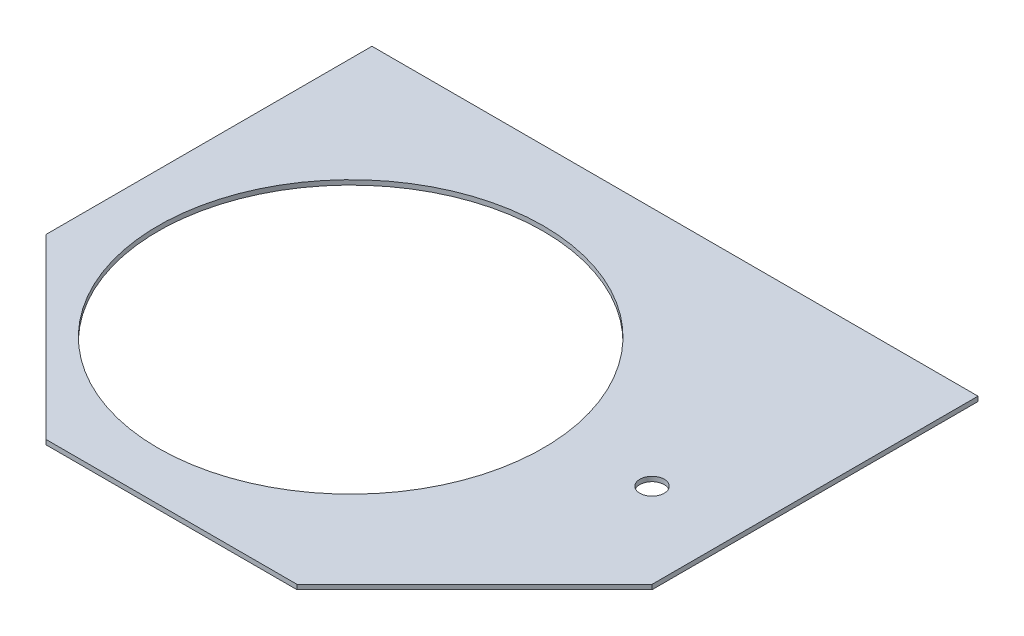
ISO-10303-21;
HEADER;
FILE_DESCRIPTION(('STEP AP214'),'2;1');
FILE_NAME('part.step','',(''),(''),'','','');
FILE_SCHEMA(('AUTOMOTIVE_DESIGN { 1 0 10303 214 1 1 1 1 }'));
ENDSEC;
DATA;
#1=APPLICATION_CONTEXT('core data for automotive mechanical design processes');
#2=APPLICATION_PROTOCOL_DEFINITION('international standard','automotive_design',2000,#1);
#3=PRODUCT_CONTEXT('',#1,'mechanical');
#4=PRODUCT('Part','Part','',(#3));
#5=PRODUCT_RELATED_PRODUCT_CATEGORY('part','',(#4));
#6=PRODUCT_DEFINITION_FORMATION('','',#4);
#7=PRODUCT_DEFINITION_CONTEXT('part definition',#1,'design');
#8=PRODUCT_DEFINITION('design','',#6,#7);
#9=PRODUCT_DEFINITION_SHAPE('','',#8);
#10=(LENGTH_UNIT() NAMED_UNIT(*) SI_UNIT(.MILLI.,.METRE.));
#11=(NAMED_UNIT(*) PLANE_ANGLE_UNIT() SI_UNIT($,.RADIAN.));
#12=(NAMED_UNIT(*) SI_UNIT($,.STERADIAN.) SOLID_ANGLE_UNIT());
#13=UNCERTAINTY_MEASURE_WITH_UNIT(LENGTH_MEASURE(1.E-05),#10,'distance_accuracy_value','');
#14=(GEOMETRIC_REPRESENTATION_CONTEXT(3) GLOBAL_UNCERTAINTY_ASSIGNED_CONTEXT((#13)) GLOBAL_UNIT_ASSIGNED_CONTEXT((#10,
#11,#12)) REPRESENTATION_CONTEXT('',''));
#15=CARTESIAN_POINT('',(0.,0.,0.));
#16=DIRECTION('',(0.,0.,1.));
#17=DIRECTION('',(1.,0.,0.));
#18=AXIS2_PLACEMENT_3D('',#15,#16,#17);
#19=CARTESIAN_POINT('',(-205.417689271226,3.175,-85.086792847484));
#20=DIRECTION('',(1.,0.,0.));
#21=DIRECTION('',(0.,0.,-1.));
#22=AXIS2_PLACEMENT_3D('',#19,#20,#21);
#23=PLANE('',#22);
#24=DIRECTION('',(0.,0.,1.));
#25=VECTOR('',#24,1.);
#26=CARTESIAN_POINT('',(-205.417689271226,0.,-85.086792847484));
#27=LINE('',#26,#25);
#28=CARTESIAN_POINT('',(-205.417689271226,0.,-135.886792847484));
#29=VERTEX_POINT('',#28);
#30=CARTESIAN_POINT('',(-205.417689271226,0.,85.0867928474841));
#31=VERTEX_POINT('',#30);
#32=EDGE_CURVE('E76',#29,#31,#27,.T.);
#33=ORIENTED_EDGE('',*,*,#32,.T.);
#34=DIRECTION('',(0.,-1.,0.));
#35=VECTOR('',#34,1.);
#36=CARTESIAN_POINT('',(-205.417689271226,3.175,85.0867928474841));
#37=LINE('',#36,#35);
#38=CARTESIAN_POINT('',(-205.417689271226,3.175,85.0867928474841));
#39=VERTEX_POINT('',#38);
#40=EDGE_CURVE('E11',#39,#31,#37,.T.);
#41=ORIENTED_EDGE('',*,*,#40,.F.);
#42=DIRECTION('',(0.,0.,1.));
#43=VECTOR('',#42,1.);
#44=CARTESIAN_POINT('',(-205.417689271226,3.175,-85.086792847484));
#45=LINE('',#44,#43);
#46=CARTESIAN_POINT('',(-205.417689271226,3.175,-135.886792847484));
#47=VERTEX_POINT('',#46);
#48=EDGE_CURVE('E82',#47,#39,#45,.T.);
#49=ORIENTED_EDGE('',*,*,#48,.F.);
#50=DIRECTION('',(0.,-1.,0.));
#51=VECTOR('',#50,1.);
#52=CARTESIAN_POINT('',(-205.417689271226,3.175,-135.886792847484));
#53=LINE('',#52,#51);
#54=EDGE_CURVE('E111',#47,#29,#53,.T.);
#55=ORIENTED_EDGE('',*,*,#54,.T.);
#56=EDGE_LOOP('',(#33,#41,#49,#55));
#57=FACE_BOUND('',#56,.T.);
#58=ADVANCED_FACE('F31',(#57),#23,.F.);
#59=CARTESIAN_POINT('',(-205.417689271226,3.175,85.0867928474841));
#60=DIRECTION('',(0.707106781186547,0.,-0.707106781186548));
#61=DIRECTION('',(-0.707106781186548,0.,-0.707106781186547));
#62=AXIS2_PLACEMENT_3D('',#59,#60,#61);
#63=PLANE('',#62);
#64=DIRECTION('',(0.707106781186548,0.,0.707106781186547));
#65=VECTOR('',#64,1.);
#66=CARTESIAN_POINT('',(-205.417689271226,0.,85.0867928474841));
#67=LINE('',#66,#65);
#68=CARTESIAN_POINT('',(-85.0867928474838,0.,205.417689271226));
#69=VERTEX_POINT('',#68);
#70=EDGE_CURVE('E116',#31,#69,#67,.T.);
#71=ORIENTED_EDGE('',*,*,#70,.T.);
#72=DIRECTION('',(0.,-1.,0.));
#73=VECTOR('',#72,1.);
#74=CARTESIAN_POINT('',(-85.0867928474838,3.175,205.417689271226));
#75=LINE('',#74,#73);
#76=CARTESIAN_POINT('',(-85.0867928474838,3.175,205.417689271226));
#77=VERTEX_POINT('',#76);
#78=EDGE_CURVE('E39',#77,#69,#75,.T.);
#79=ORIENTED_EDGE('',*,*,#78,.F.);
#80=DIRECTION('',(0.707106781186548,0.,0.707106781186547));
#81=VECTOR('',#80,1.);
#82=CARTESIAN_POINT('',(-205.417689271226,3.175,85.0867928474841));
#83=LINE('',#82,#81);
#84=EDGE_CURVE('E139',#39,#77,#83,.T.);
#85=ORIENTED_EDGE('',*,*,#84,.F.);
#86=ORIENTED_EDGE('',*,*,#40,.T.);
#87=EDGE_LOOP('',(#71,#79,#85,#86));
#88=FACE_BOUND('',#87,.T.);
#89=ADVANCED_FACE('F178',(#88),#63,.F.);
#90=CARTESIAN_POINT('',(-85.0867928474838,3.175,205.417689271226));
#91=DIRECTION('',(0.,0.,-1.));
#92=DIRECTION('',(-1.,0.,0.));
#93=AXIS2_PLACEMENT_3D('',#90,#91,#92);
#94=PLANE('',#93);
#95=DIRECTION('',(1.,0.,0.));
#96=VECTOR('',#95,1.);
#97=CARTESIAN_POINT('',(-85.0867928474838,0.,205.417689271226));
#98=LINE('',#97,#96);
#99=CARTESIAN_POINT('',(85.086792847484,0.,205.417689271226));
#100=VERTEX_POINT('',#99);
#101=EDGE_CURVE('E119',#69,#100,#98,.T.);
#102=ORIENTED_EDGE('',*,*,#101,.T.);
#103=DIRECTION('',(0.,-1.,0.));
#104=VECTOR('',#103,1.);
#105=CARTESIAN_POINT('',(85.086792847484,3.175,205.417689271226));
#106=LINE('',#105,#104);
#107=CARTESIAN_POINT('',(85.086792847484,3.175,205.417689271226));
#108=VERTEX_POINT('',#107);
#109=EDGE_CURVE('E106',#108,#100,#106,.T.);
#110=ORIENTED_EDGE('',*,*,#109,.F.);
#111=DIRECTION('',(1.,0.,0.));
#112=VECTOR('',#111,1.);
#113=CARTESIAN_POINT('',(-85.0867928474838,3.175,205.417689271226));
#114=LINE('',#113,#112);
#115=EDGE_CURVE('E96',#77,#108,#114,.T.);
#116=ORIENTED_EDGE('',*,*,#115,.F.);
#117=ORIENTED_EDGE('',*,*,#78,.T.);
#118=EDGE_LOOP('',(#102,#110,#116,#117));
#119=FACE_BOUND('',#118,.T.);
#120=ADVANCED_FACE('F132',(#119),#94,.F.);
#121=CARTESIAN_POINT('',(85.086792847484,3.175,205.417689271226));
#122=DIRECTION('',(-0.707106781186548,0.,-0.707106781186547));
#123=DIRECTION('',(-0.707106781186547,0.,0.707106781186548));
#124=AXIS2_PLACEMENT_3D('',#121,#122,#123);
#125=PLANE('',#124);
#126=DIRECTION('',(0.707106781186547,0.,-0.707106781186548));
#127=VECTOR('',#126,1.);
#128=CARTESIAN_POINT('',(85.086792847484,0.,205.417689271226));
#129=LINE('',#128,#127);
#130=CARTESIAN_POINT('',(205.417689271226,0.,85.086792847484));
#131=VERTEX_POINT('',#130);
#132=EDGE_CURVE('E105',#100,#131,#129,.T.);
#133=ORIENTED_EDGE('',*,*,#132,.T.);
#134=DIRECTION('',(0.,-1.,0.));
#135=VECTOR('',#134,1.);
#136=CARTESIAN_POINT('',(205.417689271226,3.175,85.086792847484));
#137=LINE('',#136,#135);
#138=CARTESIAN_POINT('',(205.417689271226,3.175,85.086792847484));
#139=VERTEX_POINT('',#138);
#140=EDGE_CURVE('E102',#139,#131,#137,.T.);
#141=ORIENTED_EDGE('',*,*,#140,.F.);
#142=DIRECTION('',(0.707106781186547,0.,-0.707106781186548));
#143=VECTOR('',#142,1.);
#144=CARTESIAN_POINT('',(85.086792847484,3.175,205.417689271226));
#145=LINE('',#144,#143);
#146=EDGE_CURVE('E90',#108,#139,#145,.T.);
#147=ORIENTED_EDGE('',*,*,#146,.F.);
#148=ORIENTED_EDGE('',*,*,#109,.T.);
#149=EDGE_LOOP('',(#133,#141,#147,#148));
#150=FACE_BOUND('',#149,.T.);
#151=ADVANCED_FACE('F103',(#150),#125,.F.);
#152=CARTESIAN_POINT('',(205.417689271226,3.175,-135.886792847484));
#153=DIRECTION('',(-1.,0.,0.));
#154=DIRECTION('',(0.,0.,1.));
#155=AXIS2_PLACEMENT_3D('',#152,#153,#154);
#156=PLANE('',#155);
#157=DIRECTION('',(0.,0.,-1.));
#158=VECTOR('',#157,1.);
#159=CARTESIAN_POINT('',(205.417689271226,0.,-135.886792847484));
#160=LINE('',#159,#158);
#161=CARTESIAN_POINT('',(205.417689271226,0.,-135.886792847484));
#162=VERTEX_POINT('',#161);
#163=EDGE_CURVE('E69',#131,#162,#160,.T.);
#164=ORIENTED_EDGE('',*,*,#163,.T.);
#165=DIRECTION('',(0.,-1.,0.));
#166=VECTOR('',#165,1.);
#167=CARTESIAN_POINT('',(205.417689271226,3.175,-135.886792847484));
#168=LINE('',#167,#166);
#169=CARTESIAN_POINT('',(205.417689271226,3.175,-135.886792847484));
#170=VERTEX_POINT('',#169);
#171=EDGE_CURVE('E107',#170,#162,#168,.T.);
#172=ORIENTED_EDGE('',*,*,#171,.F.);
#173=DIRECTION('',(0.,0.,-1.));
#174=VECTOR('',#173,1.);
#175=CARTESIAN_POINT('',(205.417689271226,3.175,85.086792847484));
#176=LINE('',#175,#174);
#177=EDGE_CURVE('E94',#139,#170,#176,.T.);
#178=ORIENTED_EDGE('',*,*,#177,.F.);
#179=ORIENTED_EDGE('',*,*,#140,.T.);
#180=EDGE_LOOP('',(#164,#172,#178,#179));
#181=FACE_BOUND('',#180,.T.);
#182=ADVANCED_FACE('F109',(#181),#156,.F.);
#183=CARTESIAN_POINT('',(-205.417689271226,3.175,-135.886792847484));
#184=DIRECTION('',(0.,0.,1.));
#185=DIRECTION('',(1.,0.,0.));
#186=AXIS2_PLACEMENT_3D('',#183,#184,#185);
#187=PLANE('',#186);
#188=DIRECTION('',(-1.,0.,0.));
#189=VECTOR('',#188,1.);
#190=CARTESIAN_POINT('',(-205.417689271226,0.,-135.886792847484));
#191=LINE('',#190,#189);
#192=EDGE_CURVE('E123',#162,#29,#191,.T.);
#193=ORIENTED_EDGE('',*,*,#192,.T.);
#194=ORIENTED_EDGE('',*,*,#54,.F.);
#195=DIRECTION('',(-1.,0.,0.));
#196=VECTOR('',#195,1.);
#197=CARTESIAN_POINT('',(-205.417689271226,3.175,-135.886792847484));
#198=LINE('',#197,#196);
#199=EDGE_CURVE('E47',#170,#47,#198,.T.);
#200=ORIENTED_EDGE('',*,*,#199,.F.);
#201=ORIENTED_EDGE('',*,*,#171,.T.);
#202=EDGE_LOOP('',(#193,#194,#200,#201));
#203=FACE_BOUND('',#202,.T.);
#204=ADVANCED_FACE('F137',(#203),#187,.F.);
#205=CARTESIAN_POINT('',(-205.417689271226,3.175,-135.886792847484));
#206=DIRECTION('',(0.,-1.,0.));
#207=DIRECTION('',(0.,0.,-1.));
#208=AXIS2_PLACEMENT_3D('',#205,#206,#207);
#209=PLANE('',#208);
#210=CARTESIAN_POINT('',(147.818226819717,3.175,27.487330395975));
#211=DIRECTION('',(0.,1.,0.));
#212=DIRECTION('',(0.,0.,1.));
#213=AXIS2_PLACEMENT_3D('',#210,#211,#212);
#214=CIRCLE('',#213,8.25500000000002);
#215=CARTESIAN_POINT('',(147.818226819717,3.175,35.7423303959751));
#216=VERTEX_POINT('',#215);
#217=EDGE_CURVE('E149',#216,#216,#214,.T.);
#218=ORIENTED_EDGE('',*,*,#217,.F.);
#219=EDGE_LOOP('',(#218));
#220=FACE_BOUND('',#219,.T.);
#221=CARTESIAN_POINT('',(-41.9792956670597,3.175,41.9792956670598));
#222=DIRECTION('',(0.,1.,0.));
#223=DIRECTION('',(0.,0.,1.));
#224=AXIS2_PLACEMENT_3D('',#221,#222,#223);
#225=CIRCLE('',#224,130.556);
#226=CARTESIAN_POINT('',(-41.9792956670597,3.175,172.53529566706));
#227=VERTEX_POINT('',#226);
#228=EDGE_CURVE('E143',#227,#227,#225,.T.);
#229=ORIENTED_EDGE('',*,*,#228,.F.);
#230=EDGE_LOOP('',(#229));
#231=FACE_BOUND('',#230,.T.);
#232=ORIENTED_EDGE('',*,*,#48,.T.);
#233=ORIENTED_EDGE('',*,*,#84,.T.);
#234=ORIENTED_EDGE('',*,*,#115,.T.);
#235=ORIENTED_EDGE('',*,*,#146,.T.);
#236=ORIENTED_EDGE('',*,*,#177,.T.);
#237=ORIENTED_EDGE('',*,*,#199,.T.);
#238=EDGE_LOOP('',(#232,#233,#234,#235,#236,#237));
#239=FACE_BOUND('',#238,.T.);
#240=ADVANCED_FACE('F92',(#220,#231,#239),#209,.F.);
#241=CARTESIAN_POINT('',(-205.417689271226,0.,-135.886792847484));
#242=DIRECTION('',(0.,-1.,0.));
#243=DIRECTION('',(0.,0.,-1.));
#244=AXIS2_PLACEMENT_3D('',#241,#242,#243);
#245=PLANE('',#244);
#246=CARTESIAN_POINT('',(147.818226819717,0.,27.487330395975));
#247=DIRECTION('',(0.,1.,0.));
#248=DIRECTION('',(0.,0.,1.));
#249=AXIS2_PLACEMENT_3D('',#246,#247,#248);
#250=CIRCLE('',#249,8.25500000000002);
#251=CARTESIAN_POINT('',(147.818226819717,0.,35.7423303959751));
#252=VERTEX_POINT('',#251);
#253=EDGE_CURVE('E146',#252,#252,#250,.T.);
#254=ORIENTED_EDGE('',*,*,#253,.T.);
#255=EDGE_LOOP('',(#254));
#256=FACE_BOUND('',#255,.T.);
#257=CARTESIAN_POINT('',(-41.9792956670597,0.,41.9792956670598));
#258=DIRECTION('',(0.,1.,0.));
#259=DIRECTION('',(0.,0.,1.));
#260=AXIS2_PLACEMENT_3D('',#257,#258,#259);
#261=CIRCLE('',#260,130.556);
#262=CARTESIAN_POINT('',(-41.9792956670597,0.,172.53529566706));
#263=VERTEX_POINT('',#262);
#264=EDGE_CURVE('E117',#263,#263,#261,.T.);
#265=ORIENTED_EDGE('',*,*,#264,.T.);
#266=EDGE_LOOP('',(#265));
#267=FACE_BOUND('',#266,.T.);
#268=ORIENTED_EDGE('',*,*,#32,.F.);
#269=ORIENTED_EDGE('',*,*,#192,.F.);
#270=ORIENTED_EDGE('',*,*,#163,.F.);
#271=ORIENTED_EDGE('',*,*,#132,.F.);
#272=ORIENTED_EDGE('',*,*,#101,.F.);
#273=ORIENTED_EDGE('',*,*,#70,.F.);
#274=EDGE_LOOP('',(#268,#269,#270,#271,#272,#273));
#275=FACE_BOUND('',#274,.T.);
#276=ADVANCED_FACE('F135',(#256,#267,#275),#245,.T.);
#277=CARTESIAN_POINT('',(-41.9792956670597,0.,41.9792956670598));
#278=DIRECTION('',(0.,1.,0.));
#279=DIRECTION('',(0.,0.,1.));
#280=AXIS2_PLACEMENT_3D('',#277,#278,#279);
#281=CYLINDRICAL_SURFACE('',#280,130.556);
#282=ORIENTED_EDGE('',*,*,#264,.F.);
#283=EDGE_LOOP('',(#282));
#284=FACE_BOUND('',#283,.T.);
#285=ORIENTED_EDGE('',*,*,#228,.T.);
#286=EDGE_LOOP('',(#285));
#287=FACE_BOUND('',#286,.T.);
#288=ADVANCED_FACE('F160',(#284,#287),#281,.F.);
#289=CARTESIAN_POINT('',(147.818226819717,0.,27.487330395975));
#290=DIRECTION('',(0.,1.,0.));
#291=DIRECTION('',(0.,0.,1.));
#292=AXIS2_PLACEMENT_3D('',#289,#290,#291);
#293=CYLINDRICAL_SURFACE('',#292,8.25500000000002);
#294=ORIENTED_EDGE('',*,*,#253,.F.);
#295=EDGE_LOOP('',(#294));
#296=FACE_BOUND('',#295,.T.);
#297=ORIENTED_EDGE('',*,*,#217,.T.);
#298=EDGE_LOOP('',(#297));
#299=FACE_BOUND('',#298,.T.);
#300=ADVANCED_FACE('F157',(#296,#299),#293,.F.);
#301=CLOSED_SHELL('',(#58,#89,#120,#151,#182,#204,#240,#276,#288,#300));
#302=MANIFOLD_SOLID_BREP('B2',#301);
#303=ADVANCED_BREP_SHAPE_REPRESENTATION('',(#18,#302),#14);
#304=SHAPE_DEFINITION_REPRESENTATION(#9,#303);
ENDSEC;
END-ISO-10303-21;
